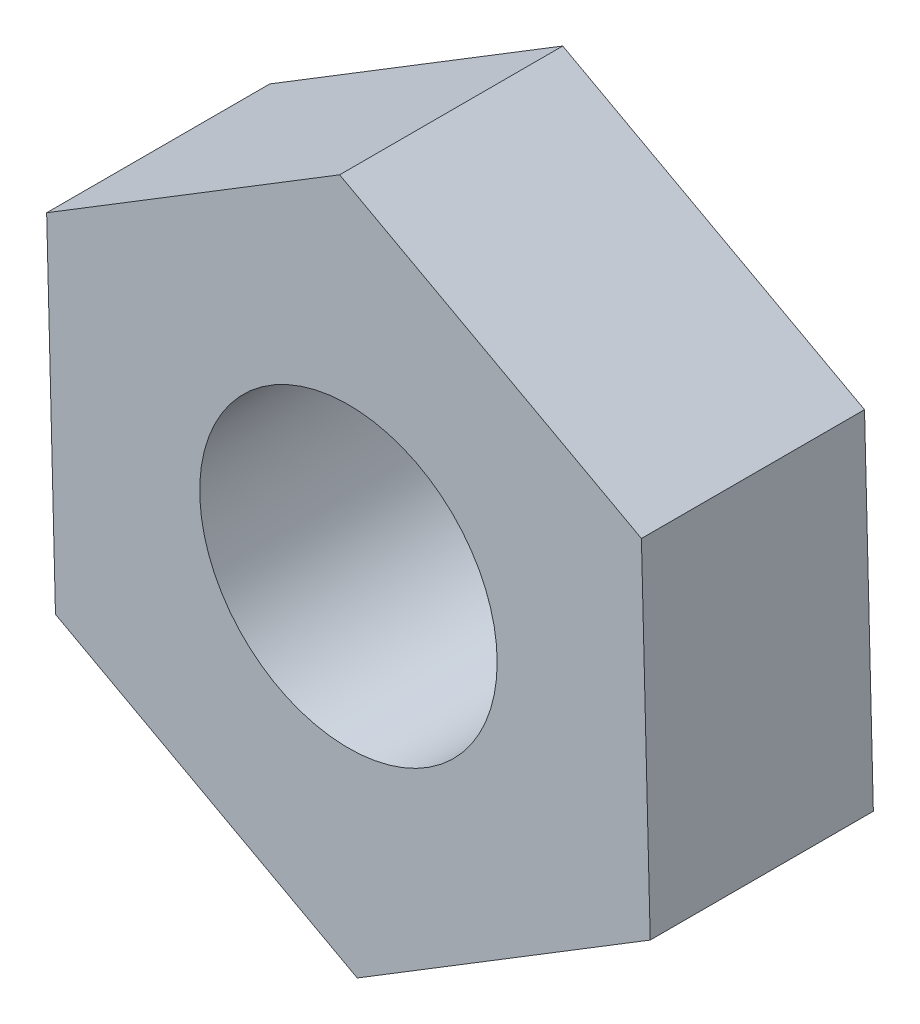
ISO-10303-21;
HEADER;
FILE_DESCRIPTION(('STEP AP214'),'2;1');
FILE_NAME('part.step','',(''),(''),'','','');
FILE_SCHEMA(('AUTOMOTIVE_DESIGN { 1 0 10303 214 1 1 1 1 }'));
ENDSEC;
DATA;
#1=APPLICATION_CONTEXT('core data for automotive mechanical design processes');
#2=APPLICATION_PROTOCOL_DEFINITION('international standard','automotive_design',2000,#1);
#3=PRODUCT_CONTEXT('',#1,'mechanical');
#4=PRODUCT('Part','Part','',(#3));
#5=PRODUCT_RELATED_PRODUCT_CATEGORY('part','',(#4));
#6=PRODUCT_DEFINITION_FORMATION('','',#4);
#7=PRODUCT_DEFINITION_CONTEXT('part definition',#1,'design');
#8=PRODUCT_DEFINITION('design','',#6,#7);
#9=PRODUCT_DEFINITION_SHAPE('','',#8);
#10=(LENGTH_UNIT() NAMED_UNIT(*) SI_UNIT(.MILLI.,.METRE.));
#11=(NAMED_UNIT(*) PLANE_ANGLE_UNIT() SI_UNIT($,.RADIAN.));
#12=(NAMED_UNIT(*) SI_UNIT($,.STERADIAN.) SOLID_ANGLE_UNIT());
#13=UNCERTAINTY_MEASURE_WITH_UNIT(LENGTH_MEASURE(1.E-05),#10,'distance_accuracy_value','');
#14=(GEOMETRIC_REPRESENTATION_CONTEXT(3) GLOBAL_UNCERTAINTY_ASSIGNED_CONTEXT((#13)) GLOBAL_UNIT_ASSIGNED_CONTEXT((#10,
#11,#12)) REPRESENTATION_CONTEXT('',''));
#15=CARTESIAN_POINT('',(0.,0.,0.));
#16=DIRECTION('',(0.,0.,1.));
#17=DIRECTION('',(1.,0.,0.));
#18=AXIS2_PLACEMENT_3D('',#15,#16,#17);
#19=CARTESIAN_POINT('',(0.0592615424447319,-2.30864059630779,1.5));
#20=DIRECTION('',(-0.522058429569426,0.852909723309276,0.));
#21=DIRECTION('',(-0.852909723309276,-0.522058429569426,0.));
#22=AXIS2_PLACEMENT_3D('',#19,#20,#21);
#23=PLANE('',#22);
#24=DIRECTION('',(0.852909723309276,0.522058429569426,0.));
#25=VECTOR('',#24,1.);
#26=CARTESIAN_POINT('',(0.0592615424447319,-2.30864059630779,0.));
#27=LINE('',#26,#25);
#28=CARTESIAN_POINT('',(0.0592615424447319,-2.30864059630779,0.));
#29=VERTEX_POINT('',#28);
#30=CARTESIAN_POINT('',(2.02897217583297,-1.10299829692931,0.));
#31=VERTEX_POINT('',#30);
#32=EDGE_CURVE('E120',#29,#31,#27,.T.);
#33=ORIENTED_EDGE('',*,*,#32,.T.);
#34=DIRECTION('',(0.,0.,-1.));
#35=VECTOR('',#34,1.);
#36=CARTESIAN_POINT('',(2.02897217583297,-1.10299829692931,1.5));
#37=LINE('',#36,#35);
#38=CARTESIAN_POINT('',(2.02897217583297,-1.10299829692931,1.5));
#39=VERTEX_POINT('',#38);
#40=EDGE_CURVE('E11',#39,#31,#37,.T.);
#41=ORIENTED_EDGE('',*,*,#40,.F.);
#42=DIRECTION('',(0.852909723309276,0.522058429569426,0.));
#43=VECTOR('',#42,1.);
#44=CARTESIAN_POINT('',(0.0592615424447319,-2.30864059630779,1.5));
#45=LINE('',#44,#43);
#46=CARTESIAN_POINT('',(0.0592615424447319,-2.30864059630779,1.5));
#47=VERTEX_POINT('',#46);
#48=EDGE_CURVE('E130',#47,#39,#45,.T.);
#49=ORIENTED_EDGE('',*,*,#48,.F.);
#50=DIRECTION('',(0.,0.,-1.));
#51=VECTOR('',#50,1.);
#52=CARTESIAN_POINT('',(0.0592615424447319,-2.30864059630779,1.5));
#53=LINE('',#52,#51);
#54=EDGE_CURVE('E116',#47,#29,#53,.T.);
#55=ORIENTED_EDGE('',*,*,#54,.T.);
#56=EDGE_LOOP('',(#33,#41,#49,#55));
#57=FACE_BOUND('',#56,.T.);
#58=ADVANCED_FACE('F35',(#57),#23,.F.);
#59=CARTESIAN_POINT('',(2.02897217583297,-1.10299829692931,1.5));
#60=DIRECTION('',(-0.999670702305302,-0.0256610006122939,0.));
#61=DIRECTION('',(0.0256610006122939,-0.999670702305302,0.));
#62=AXIS2_PLACEMENT_3D('',#59,#60,#61);
#63=PLANE('',#62);
#64=DIRECTION('',(-0.0256610006122939,0.999670702305302,0.));
#65=VECTOR('',#64,1.);
#66=CARTESIAN_POINT('',(2.02897217583297,-1.10299829692931,0.));
#67=LINE('',#66,#65);
#68=CARTESIAN_POINT('',(1.96971063338824,1.20564229937848,0.));
#69=VERTEX_POINT('',#68);
#70=EDGE_CURVE('E123',#31,#69,#67,.T.);
#71=ORIENTED_EDGE('',*,*,#70,.T.);
#72=DIRECTION('',(0.,0.,-1.));
#73=VECTOR('',#72,1.);
#74=CARTESIAN_POINT('',(1.96971063338824,1.20564229937848,1.5));
#75=LINE('',#74,#73);
#76=CARTESIAN_POINT('',(1.96971063338824,1.20564229937848,1.5));
#77=VERTEX_POINT('',#76);
#78=EDGE_CURVE('E44',#77,#69,#75,.T.);
#79=ORIENTED_EDGE('',*,*,#78,.F.);
#80=DIRECTION('',(-0.0256610006122939,0.999670702305302,0.));
#81=VECTOR('',#80,1.);
#82=CARTESIAN_POINT('',(2.02897217583297,-1.10299829692931,1.5));
#83=LINE('',#82,#81);
#84=EDGE_CURVE('E89',#39,#77,#83,.T.);
#85=ORIENTED_EDGE('',*,*,#84,.F.);
#86=ORIENTED_EDGE('',*,*,#40,.T.);
#87=EDGE_LOOP('',(#71,#79,#85,#86));
#88=FACE_BOUND('',#87,.T.);
#89=ADVANCED_FACE('F156',(#88),#63,.F.);
#90=CARTESIAN_POINT('',(1.96971063338824,1.20564229937848,1.5));
#91=DIRECTION('',(-0.477612272735877,-0.878570723921569,0.));
#92=DIRECTION('',(0.878570723921569,-0.477612272735877,0.));
#93=AXIS2_PLACEMENT_3D('',#90,#91,#92);
#94=PLANE('',#93);
#95=DIRECTION('',(-0.878570723921569,0.477612272735877,0.));
#96=VECTOR('',#95,1.);
#97=CARTESIAN_POINT('',(1.96971063338824,1.20564229937848,0.));
#98=LINE('',#97,#96);
#99=CARTESIAN_POINT('',(-0.0592615424447312,2.30864059630779,0.));
#100=VERTEX_POINT('',#99);
#101=EDGE_CURVE('E125',#69,#100,#98,.T.);
#102=ORIENTED_EDGE('',*,*,#101,.T.);
#103=DIRECTION('',(0.,0.,-1.));
#104=VECTOR('',#103,1.);
#105=CARTESIAN_POINT('',(-0.0592615424447312,2.30864059630779,1.5));
#106=LINE('',#105,#104);
#107=CARTESIAN_POINT('',(-0.0592615424447312,2.30864059630779,1.5));
#108=VERTEX_POINT('',#107);
#109=EDGE_CURVE('E111',#108,#100,#106,.T.);
#110=ORIENTED_EDGE('',*,*,#109,.F.);
#111=DIRECTION('',(-0.878570723921569,0.477612272735877,0.));
#112=VECTOR('',#111,1.);
#113=CARTESIAN_POINT('',(1.96971063338824,1.20564229937848,1.5));
#114=LINE('',#113,#112);
#115=EDGE_CURVE('E102',#77,#108,#114,.T.);
#116=ORIENTED_EDGE('',*,*,#115,.F.);
#117=ORIENTED_EDGE('',*,*,#78,.T.);
#118=EDGE_LOOP('',(#102,#110,#116,#117));
#119=FACE_BOUND('',#118,.T.);
#120=ADVANCED_FACE('F137',(#119),#94,.F.);
#121=CARTESIAN_POINT('',(-0.0592615424447312,2.30864059630779,1.5));
#122=DIRECTION('',(0.522058429569425,-0.852909723309276,0.));
#123=DIRECTION('',(0.852909723309276,0.522058429569425,0.));
#124=AXIS2_PLACEMENT_3D('',#121,#122,#123);
#125=PLANE('',#124);
#126=DIRECTION('',(-0.852909723309276,-0.522058429569425,0.));
#127=VECTOR('',#126,1.);
#128=CARTESIAN_POINT('',(-0.0592615424447312,2.30864059630779,0.));
#129=LINE('',#128,#127);
#130=CARTESIAN_POINT('',(-2.02897217583297,1.10299829692931,0.));
#131=VERTEX_POINT('',#130);
#132=EDGE_CURVE('E110',#100,#131,#129,.T.);
#133=ORIENTED_EDGE('',*,*,#132,.T.);
#134=DIRECTION('',(0.,0.,-1.));
#135=VECTOR('',#134,1.);
#136=CARTESIAN_POINT('',(-2.02897217583297,1.10299829692931,1.5));
#137=LINE('',#136,#135);
#138=CARTESIAN_POINT('',(-2.02897217583297,1.10299829692931,1.5));
#139=VERTEX_POINT('',#138);
#140=EDGE_CURVE('E107',#139,#131,#137,.T.);
#141=ORIENTED_EDGE('',*,*,#140,.F.);
#142=DIRECTION('',(-0.852909723309276,-0.522058429569425,0.));
#143=VECTOR('',#142,1.);
#144=CARTESIAN_POINT('',(-0.0592615424447312,2.30864059630779,1.5));
#145=LINE('',#144,#143);
#146=EDGE_CURVE('E96',#108,#139,#145,.T.);
#147=ORIENTED_EDGE('',*,*,#146,.F.);
#148=ORIENTED_EDGE('',*,*,#109,.T.);
#149=EDGE_LOOP('',(#133,#141,#147,#148));
#150=FACE_BOUND('',#149,.T.);
#151=ADVANCED_FACE('F108',(#150),#125,.F.);
#152=CARTESIAN_POINT('',(-2.02897217583297,1.10299829692931,1.5));
#153=DIRECTION('',(0.999670702305302,0.0256610006122935,0.));
#154=DIRECTION('',(-0.0256610006122935,0.999670702305302,0.));
#155=AXIS2_PLACEMENT_3D('',#152,#153,#154);
#156=PLANE('',#155);
#157=DIRECTION('',(0.0256610006122935,-0.999670702305302,0.));
#158=VECTOR('',#157,1.);
#159=CARTESIAN_POINT('',(-2.02897217583297,1.10299829692931,0.));
#160=LINE('',#159,#158);
#161=CARTESIAN_POINT('',(-1.96971063338824,-1.20564229937848,0.));
#162=VERTEX_POINT('',#161);
#163=EDGE_CURVE('E75',#131,#162,#160,.T.);
#164=ORIENTED_EDGE('',*,*,#163,.T.);
#165=DIRECTION('',(0.,0.,-1.));
#166=VECTOR('',#165,1.);
#167=CARTESIAN_POINT('',(-1.96971063338824,-1.20564229937848,1.5));
#168=LINE('',#167,#166);
#169=CARTESIAN_POINT('',(-1.96971063338824,-1.20564229937848,1.5));
#170=VERTEX_POINT('',#169);
#171=EDGE_CURVE('E112',#170,#162,#168,.T.);
#172=ORIENTED_EDGE('',*,*,#171,.F.);
#173=DIRECTION('',(0.0256610006122935,-0.999670702305302,0.));
#174=VECTOR('',#173,1.);
#175=CARTESIAN_POINT('',(-2.02897217583297,1.10299829692931,1.5));
#176=LINE('',#175,#174);
#177=EDGE_CURVE('E100',#139,#170,#176,.T.);
#178=ORIENTED_EDGE('',*,*,#177,.F.);
#179=ORIENTED_EDGE('',*,*,#140,.T.);
#180=EDGE_LOOP('',(#164,#172,#178,#179));
#181=FACE_BOUND('',#180,.T.);
#182=ADVANCED_FACE('F114',(#181),#156,.F.);
#183=CARTESIAN_POINT('',(-1.96971063338824,-1.20564229937848,1.5));
#184=DIRECTION('',(0.477612272735877,0.878570723921569,0.));
#185=DIRECTION('',(-0.87857072392157,0.477612272735877,0.));
#186=AXIS2_PLACEMENT_3D('',#183,#184,#185);
#187=PLANE('',#186);
#188=DIRECTION('',(0.878570723921569,-0.477612272735877,0.));
#189=VECTOR('',#188,1.);
#190=CARTESIAN_POINT('',(-1.96971063338824,-1.20564229937848,0.));
#191=LINE('',#190,#189);
#192=EDGE_CURVE('E81',#162,#29,#191,.T.);
#193=ORIENTED_EDGE('',*,*,#192,.T.);
#194=ORIENTED_EDGE('',*,*,#54,.F.);
#195=DIRECTION('',(0.878570723921569,-0.477612272735877,0.));
#196=VECTOR('',#195,1.);
#197=CARTESIAN_POINT('',(-1.96971063338824,-1.20564229937848,1.5));
#198=LINE('',#197,#196);
#199=EDGE_CURVE('E52',#170,#47,#198,.T.);
#200=ORIENTED_EDGE('',*,*,#199,.F.);
#201=ORIENTED_EDGE('',*,*,#171,.T.);
#202=EDGE_LOOP('',(#193,#194,#200,#201));
#203=FACE_BOUND('',#202,.T.);
#204=ADVANCED_FACE('F144',(#203),#187,.F.);
#205=CARTESIAN_POINT('',(0.,0.,1.5));
#206=DIRECTION('',(0.,0.,1.));
#207=DIRECTION('',(1.,0.,0.));
#208=AXIS2_PLACEMENT_3D('',#205,#206,#207);
#209=PLANE('',#208);
#210=CARTESIAN_POINT('',(0.,0.,1.5));
#211=DIRECTION('',(0.,0.,1.));
#212=DIRECTION('',(1.,0.,0.));
#213=AXIS2_PLACEMENT_3D('',#210,#211,#212);
#214=CIRCLE('',#213,1.);
#215=CARTESIAN_POINT('',(1.,0.,1.5));
#216=VERTEX_POINT('',#215);
#217=EDGE_CURVE('E209',#216,#216,#214,.T.);
#218=ORIENTED_EDGE('',*,*,#217,.F.);
#219=EDGE_LOOP('',(#218));
#220=FACE_BOUND('',#219,.T.);
#221=ORIENTED_EDGE('',*,*,#48,.T.);
#222=ORIENTED_EDGE('',*,*,#84,.T.);
#223=ORIENTED_EDGE('',*,*,#115,.T.);
#224=ORIENTED_EDGE('',*,*,#146,.T.);
#225=ORIENTED_EDGE('',*,*,#177,.T.);
#226=ORIENTED_EDGE('',*,*,#199,.T.);
#227=EDGE_LOOP('',(#221,#222,#223,#224,#225,#226));
#228=FACE_BOUND('',#227,.T.);
#229=ADVANCED_FACE('F98',(#220,#228),#209,.T.);
#230=CARTESIAN_POINT('',(0.,0.,0.));
#231=DIRECTION('',(0.,0.,1.));
#232=DIRECTION('',(1.,0.,0.));
#233=AXIS2_PLACEMENT_3D('',#230,#231,#232);
#234=PLANE('',#233);
#235=CARTESIAN_POINT('',(0.,0.,0.));
#236=DIRECTION('',(0.,0.,1.));
#237=DIRECTION('',(1.,0.,0.));
#238=AXIS2_PLACEMENT_3D('',#235,#236,#237);
#239=CIRCLE('',#238,1.);
#240=CARTESIAN_POINT('',(1.,0.,0.));
#241=VERTEX_POINT('',#240);
#242=EDGE_CURVE('E38',#241,#241,#239,.T.);
#243=ORIENTED_EDGE('',*,*,#242,.T.);
#244=EDGE_LOOP('',(#243));
#245=FACE_BOUND('',#244,.T.);
#246=ORIENTED_EDGE('',*,*,#32,.F.);
#247=ORIENTED_EDGE('',*,*,#192,.F.);
#248=ORIENTED_EDGE('',*,*,#163,.F.);
#249=ORIENTED_EDGE('',*,*,#132,.F.);
#250=ORIENTED_EDGE('',*,*,#101,.F.);
#251=ORIENTED_EDGE('',*,*,#70,.F.);
#252=EDGE_LOOP('',(#246,#247,#248,#249,#250,#251));
#253=FACE_BOUND('',#252,.T.);
#254=ADVANCED_FACE('F140',(#245,#253),#234,.F.);
#255=CARTESIAN_POINT('',(0.,0.,-0.5));
#256=DIRECTION('',(0.,0.,1.));
#257=DIRECTION('',(1.,0.,0.));
#258=AXIS2_PLACEMENT_3D('',#255,#256,#257);
#259=CYLINDRICAL_SURFACE('',#258,1.);
#260=ORIENTED_EDGE('',*,*,#217,.T.);
#261=EDGE_LOOP('',(#260));
#262=FACE_BOUND('',#261,.T.);
#263=ORIENTED_EDGE('',*,*,#242,.F.);
#264=EDGE_LOOP('',(#263));
#265=FACE_BOUND('',#264,.T.);
#266=ADVANCED_FACE('F193',(#262,#265),#259,.F.);
#267=CLOSED_SHELL('',(#58,#89,#120,#151,#182,#204,#229,#254,#266));
#268=MANIFOLD_SOLID_BREP('B2',#267);
#269=ADVANCED_BREP_SHAPE_REPRESENTATION('',(#18,#268),#14);
#270=SHAPE_DEFINITION_REPRESENTATION(#9,#269);
ENDSEC;
END-ISO-10303-21;
